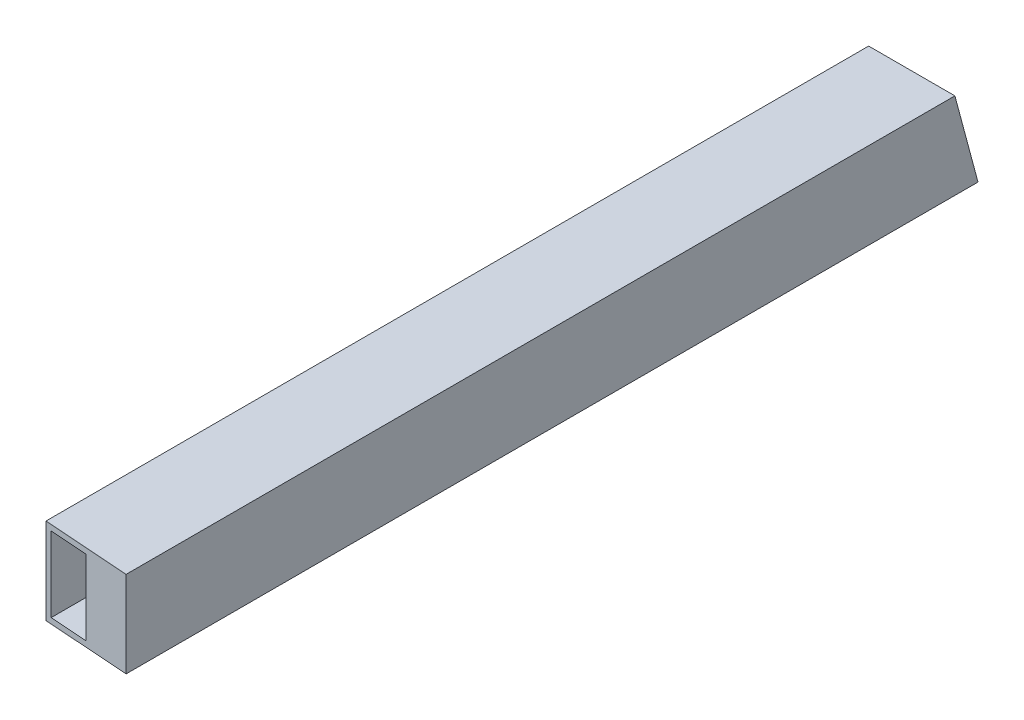
ISO-10303-21;
HEADER;
FILE_DESCRIPTION(('STEP AP214'),'2;1');
FILE_NAME('part.step','',(''),(''),'','','');
FILE_SCHEMA(('AUTOMOTIVE_DESIGN { 1 0 10303 214 1 1 1 1 }'));
ENDSEC;
DATA;
#1=APPLICATION_CONTEXT('core data for automotive mechanical design processes');
#2=APPLICATION_PROTOCOL_DEFINITION('international standard','automotive_design',2000,#1);
#3=PRODUCT_CONTEXT('',#1,'mechanical');
#4=PRODUCT('Part','Part','',(#3));
#5=PRODUCT_RELATED_PRODUCT_CATEGORY('part','',(#4));
#6=PRODUCT_DEFINITION_FORMATION('','',#4);
#7=PRODUCT_DEFINITION_CONTEXT('part definition',#1,'design');
#8=PRODUCT_DEFINITION('design','',#6,#7);
#9=PRODUCT_DEFINITION_SHAPE('','',#8);
#10=(LENGTH_UNIT() NAMED_UNIT(*) SI_UNIT(.MILLI.,.METRE.));
#11=(NAMED_UNIT(*) PLANE_ANGLE_UNIT() SI_UNIT($,.RADIAN.));
#12=(NAMED_UNIT(*) SI_UNIT($,.STERADIAN.) SOLID_ANGLE_UNIT());
#13=UNCERTAINTY_MEASURE_WITH_UNIT(LENGTH_MEASURE(1.E-05),#10,'distance_accuracy_value','');
#14=(GEOMETRIC_REPRESENTATION_CONTEXT(3) GLOBAL_UNCERTAINTY_ASSIGNED_CONTEXT((#13)) GLOBAL_UNIT_ASSIGNED_CONTEXT((#10,
#11,#12)) REPRESENTATION_CONTEXT('',''));
#15=CARTESIAN_POINT('',(0.,0.,0.));
#16=DIRECTION('',(0.,0.,1.));
#17=DIRECTION('',(1.,0.,0.));
#18=AXIS2_PLACEMENT_3D('',#15,#16,#17);
#19=CARTESIAN_POINT('',(-12.7,12.7,250.));
#20=DIRECTION('',(1.,0.,0.));
#21=DIRECTION('',(0.,0.,-1.));
#22=AXIS2_PLACEMENT_3D('',#19,#20,#21);
#23=PLANE('',#22);
#24=DIRECTION('',(0.,0.,-1.));
#25=VECTOR('',#24,1.);
#26=CARTESIAN_POINT('',(-12.7,12.7,250.));
#27=LINE('',#26,#25);
#28=CARTESIAN_POINT('',(-12.7,12.7,249.090766652216));
#29=VERTEX_POINT('',#28);
#30=CARTESIAN_POINT('',(-12.7,12.7,6.80590948775034));
#31=VERTEX_POINT('',#30);
#32=EDGE_CURVE('E112',#29,#31,#27,.T.);
#33=ORIENTED_EDGE('',*,*,#32,.T.);
#34=DIRECTION('',(0.,-0.96592582628907,-0.258819045102515));
#35=VECTOR('',#34,1.);
#36=CARTESIAN_POINT('',(-12.7,-12.7,0.));
#37=LINE('',#36,#35);
#38=CARTESIAN_POINT('',(-12.7,-12.7,0.));
#39=VERTEX_POINT('',#38);
#40=EDGE_CURVE('E104',#31,#39,#37,.T.);
#41=ORIENTED_EDGE('',*,*,#40,.T.);
#42=DIRECTION('',(0.,0.,-1.));
#43=VECTOR('',#42,1.);
#44=CARTESIAN_POINT('',(-12.7,-12.7,250.));
#45=LINE('',#44,#43);
#46=CARTESIAN_POINT('',(-12.7,-12.7,249.090766652216));
#47=VERTEX_POINT('',#46);
#48=EDGE_CURVE('E119',#47,#39,#45,.T.);
#49=ORIENTED_EDGE('',*,*,#48,.F.);
#50=DIRECTION('',(0.,-1.,0.));
#51=VECTOR('',#50,1.);
#52=CARTESIAN_POINT('',(-12.7,12.7,249.090766652216));
#53=LINE('',#52,#51);
#54=EDGE_CURVE('E153',#29,#47,#53,.T.);
#55=ORIENTED_EDGE('',*,*,#54,.F.);
#56=EDGE_LOOP('',(#33,#41,#49,#55));
#57=FACE_BOUND('',#56,.T.);
#58=ADVANCED_FACE('F33',(#57),#23,.F.);
#59=CARTESIAN_POINT('',(12.7,-12.7,250.));
#60=DIRECTION('',(0.,1.,0.));
#61=DIRECTION('',(-1.,0.,0.));
#62=AXIS2_PLACEMENT_3D('',#59,#60,#61);
#63=PLANE('',#62);
#64=DIRECTION('',(0.997447018462015,0.,0.0714104009317801));
#65=VECTOR('',#64,1.);
#66=CARTESIAN_POINT('',(12.6352370439123,-12.7,250.904596762007));
#67=LINE('',#66,#65);
#68=CARTESIAN_POINT('',(12.7,-12.7,250.909233347784));
#69=VERTEX_POINT('',#68);
#70=EDGE_CURVE('E125',#47,#69,#67,.T.);
#71=ORIENTED_EDGE('',*,*,#70,.F.);
#72=ORIENTED_EDGE('',*,*,#48,.T.);
#73=DIRECTION('',(1.,0.,0.));
#74=VECTOR('',#73,1.);
#75=CARTESIAN_POINT('',(12.7,-12.7,0.));
#76=LINE('',#75,#74);
#77=CARTESIAN_POINT('',(12.7,-12.7,0.));
#78=VERTEX_POINT('',#77);
#79=EDGE_CURVE('E101',#39,#78,#76,.T.);
#80=ORIENTED_EDGE('',*,*,#79,.T.);
#81=DIRECTION('',(0.,0.,-1.));
#82=VECTOR('',#81,1.);
#83=CARTESIAN_POINT('',(12.7,-12.7,250.));
#84=LINE('',#83,#82);
#85=EDGE_CURVE('E126',#69,#78,#84,.T.);
#86=ORIENTED_EDGE('',*,*,#85,.F.);
#87=EDGE_LOOP('',(#71,#72,#80,#86));
#88=FACE_BOUND('',#87,.T.);
#89=ADVANCED_FACE('F124',(#88),#63,.F.);
#90=CARTESIAN_POINT('',(12.7,12.7,250.));
#91=DIRECTION('',(-1.,0.,0.));
#92=DIRECTION('',(0.,-1.,0.));
#93=AXIS2_PLACEMENT_3D('',#90,#91,#92);
#94=PLANE('',#93);
#95=ORIENTED_EDGE('',*,*,#85,.T.);
#96=DIRECTION('',(0.,-0.96592582628907,-0.258819045102515));
#97=VECTOR('',#96,1.);
#98=CARTESIAN_POINT('',(12.7,-12.7,0.));
#99=LINE('',#98,#97);
#100=CARTESIAN_POINT('',(12.7,12.7,6.80590948775034));
#101=VERTEX_POINT('',#100);
#102=EDGE_CURVE('E107',#101,#78,#99,.T.);
#103=ORIENTED_EDGE('',*,*,#102,.F.);
#104=DIRECTION('',(0.,0.,-1.));
#105=VECTOR('',#104,1.);
#106=CARTESIAN_POINT('',(12.7,12.7,250.));
#107=LINE('',#106,#105);
#108=CARTESIAN_POINT('',(12.7,12.7,250.909233347784));
#109=VERTEX_POINT('',#108);
#110=EDGE_CURVE('E128',#109,#101,#107,.T.);
#111=ORIENTED_EDGE('',*,*,#110,.F.);
#112=DIRECTION('',(0.,1.,0.));
#113=VECTOR('',#112,1.);
#114=CARTESIAN_POINT('',(12.7,12.7,250.909233347784));
#115=LINE('',#114,#113);
#116=EDGE_CURVE('E54',#69,#109,#115,.T.);
#117=ORIENTED_EDGE('',*,*,#116,.F.);
#118=EDGE_LOOP('',(#95,#103,#111,#117));
#119=FACE_BOUND('',#118,.T.);
#120=ADVANCED_FACE('F212',(#119),#94,.F.);
#121=CARTESIAN_POINT('',(12.7,12.7,250.));
#122=DIRECTION('',(0.,-1.,0.));
#123=DIRECTION('',(1.,0.,0.));
#124=AXIS2_PLACEMENT_3D('',#121,#122,#123);
#125=PLANE('',#124);
#126=ORIENTED_EDGE('',*,*,#110,.T.);
#127=DIRECTION('',(-1.,0.,0.));
#128=VECTOR('',#127,1.);
#129=CARTESIAN_POINT('',(12.7,12.7,6.80590948775034));
#130=LINE('',#129,#128);
#131=EDGE_CURVE('E168',#101,#31,#130,.T.);
#132=ORIENTED_EDGE('',*,*,#131,.T.);
#133=ORIENTED_EDGE('',*,*,#32,.F.);
#134=DIRECTION('',(-0.997447018462015,0.,-0.0714104009317801));
#135=VECTOR('',#134,1.);
#136=CARTESIAN_POINT('',(30.9804418358443,12.7,252.217988255609));
#137=LINE('',#136,#135);
#138=EDGE_CURVE('E166',#109,#29,#137,.T.);
#139=ORIENTED_EDGE('',*,*,#138,.F.);
#140=EDGE_LOOP('',(#126,#132,#133,#139));
#141=FACE_BOUND('',#140,.T.);
#142=ADVANCED_FACE('F216',(#141),#125,.F.);
#143=CARTESIAN_POINT('',(-11.049,11.049,250.));
#144=DIRECTION('',(1.,0.,0.));
#145=DIRECTION('',(0.,1.,0.));
#146=AXIS2_PLACEMENT_3D('',#143,#144,#145);
#147=PLANE('',#146);
#148=DIRECTION('',(0.,-0.96592582628907,-0.258819045102515));
#149=VECTOR('',#148,1.);
#150=CARTESIAN_POINT('',(-11.049,71.958118657237,22.6840745269443));
#151=LINE('',#150,#149);
#152=CARTESIAN_POINT('',(-11.049,11.049,6.36352537104656));
#153=VERTEX_POINT('',#152);
#154=CARTESIAN_POINT('',(-11.049,-11.049,0.442384116703775));
#155=VERTEX_POINT('',#154);
#156=EDGE_CURVE('E170',#153,#155,#151,.T.);
#157=ORIENTED_EDGE('',*,*,#156,.F.);
#158=DIRECTION('',(0.,0.,-1.));
#159=VECTOR('',#158,1.);
#160=CARTESIAN_POINT('',(-11.049,11.049,250.));
#161=LINE('',#160,#159);
#162=CARTESIAN_POINT('',(-11.049,11.049,249.208966987428));
#163=VERTEX_POINT('',#162);
#164=EDGE_CURVE('E142',#163,#153,#161,.T.);
#165=ORIENTED_EDGE('',*,*,#164,.F.);
#166=DIRECTION('',(0.,-1.,0.));
#167=VECTOR('',#166,1.);
#168=CARTESIAN_POINT('',(-11.049,11.049,249.208966987428));
#169=LINE('',#168,#167);
#170=CARTESIAN_POINT('',(-11.049,-11.049,249.208966987428));
#171=VERTEX_POINT('',#170);
#172=EDGE_CURVE('E157',#163,#171,#169,.T.);
#173=ORIENTED_EDGE('',*,*,#172,.T.);
#174=DIRECTION('',(0.,0.,-1.));
#175=VECTOR('',#174,1.);
#176=CARTESIAN_POINT('',(-11.049,-11.049,250.));
#177=LINE('',#176,#175);
#178=EDGE_CURVE('E113',#171,#155,#177,.T.);
#179=ORIENTED_EDGE('',*,*,#178,.T.);
#180=EDGE_LOOP('',(#157,#165,#173,#179));
#181=FACE_BOUND('',#180,.T.);
#182=ADVANCED_FACE('F180',(#181),#147,.T.);
#183=CARTESIAN_POINT('',(11.049,-11.049,250.));
#184=DIRECTION('',(0.,1.,0.));
#185=DIRECTION('',(-1.,0.,0.));
#186=AXIS2_PLACEMENT_3D('',#183,#184,#185);
#187=PLANE('',#186);
#188=DIRECTION('',(1.,0.,0.));
#189=VECTOR('',#188,1.);
#190=CARTESIAN_POINT('',(11.049,-11.049,0.442384116703776));
#191=LINE('',#190,#189);
#192=CARTESIAN_POINT('',(11.049,-11.049,0.44238411670384));
#193=VERTEX_POINT('',#192);
#194=EDGE_CURVE('E46',#155,#193,#191,.T.);
#195=ORIENTED_EDGE('',*,*,#194,.F.);
#196=ORIENTED_EDGE('',*,*,#178,.F.);
#197=DIRECTION('',(0.997447018462015,0.,0.0714104009317801));
#198=VECTOR('',#197,1.);
#199=CARTESIAN_POINT('',(10.9926562282037,-11.049,250.786999182946));
#200=LINE('',#199,#198);
#201=CARTESIAN_POINT('',(0.,-11.049,250.));
#202=VERTEX_POINT('',#201);
#203=EDGE_CURVE('E160',#171,#202,#200,.T.);
#204=ORIENTED_EDGE('',*,*,#203,.T.);
#205=DIRECTION('',(1.,0.,0.));
#206=VECTOR('',#205,1.);
#207=CARTESIAN_POINT('',(11.049,-11.049,250.));
#208=LINE('',#207,#206);
#209=CARTESIAN_POINT('',(11.049,-11.049,250.));
#210=VERTEX_POINT('',#209);
#211=EDGE_CURVE('E151',#202,#210,#208,.T.);
#212=ORIENTED_EDGE('',*,*,#211,.T.);
#213=DIRECTION('',(0.,0.,-1.));
#214=VECTOR('',#213,1.);
#215=CARTESIAN_POINT('',(11.049,-11.049,250.));
#216=LINE('',#215,#214);
#217=EDGE_CURVE('E136',#210,#193,#216,.T.);
#218=ORIENTED_EDGE('',*,*,#217,.T.);
#219=EDGE_LOOP('',(#195,#196,#204,#212,#218));
#220=FACE_BOUND('',#219,.T.);
#221=ADVANCED_FACE('F192',(#220),#187,.T.);
#222=CARTESIAN_POINT('',(11.049,11.049,250.));
#223=DIRECTION('',(0.,-1.,0.));
#224=DIRECTION('',(1.,0.,0.));
#225=AXIS2_PLACEMENT_3D('',#222,#223,#224);
#226=PLANE('',#225);
#227=DIRECTION('',(-1.,0.,0.));
#228=VECTOR('',#227,1.);
#229=CARTESIAN_POINT('',(11.049,11.049,6.36352537104656));
#230=LINE('',#229,#228);
#231=CARTESIAN_POINT('',(11.049,11.049,6.36352537104659));
#232=VERTEX_POINT('',#231);
#233=EDGE_CURVE('E121',#232,#153,#230,.T.);
#234=ORIENTED_EDGE('',*,*,#233,.F.);
#235=DIRECTION('',(0.,0.,-1.));
#236=VECTOR('',#235,1.);
#237=CARTESIAN_POINT('',(11.049,11.049,250.));
#238=LINE('',#237,#236);
#239=CARTESIAN_POINT('',(11.049,11.049,250.));
#240=VERTEX_POINT('',#239);
#241=EDGE_CURVE('E139',#240,#232,#238,.T.);
#242=ORIENTED_EDGE('',*,*,#241,.F.);
#243=DIRECTION('',(-1.,0.,0.));
#244=VECTOR('',#243,1.);
#245=CARTESIAN_POINT('',(11.049,11.049,250.));
#246=LINE('',#245,#244);
#247=CARTESIAN_POINT('',(0.,11.049,250.));
#248=VERTEX_POINT('',#247);
#249=EDGE_CURVE('E145',#240,#248,#246,.T.);
#250=ORIENTED_EDGE('',*,*,#249,.T.);
#251=DIRECTION('',(-0.997447018462015,0.,-0.0714104009317801));
#252=VECTOR('',#251,1.);
#253=CARTESIAN_POINT('',(10.9926562282037,11.049,250.786999182946));
#254=LINE('',#253,#252);
#255=EDGE_CURVE('E163',#248,#163,#254,.T.);
#256=ORIENTED_EDGE('',*,*,#255,.T.);
#257=ORIENTED_EDGE('',*,*,#164,.T.);
#258=EDGE_LOOP('',(#234,#242,#250,#256,#257));
#259=FACE_BOUND('',#258,.T.);
#260=ADVANCED_FACE('F182',(#259),#226,.T.);
#261=CARTESIAN_POINT('',(0.,0.,250.));
#262=DIRECTION('',(0.,0.,1.));
#263=DIRECTION('',(1.,0.,0.));
#264=AXIS2_PLACEMENT_3D('',#261,#262,#263);
#265=PLANE('',#264);
#266=DIRECTION('',(0.,-1.,0.));
#267=VECTOR('',#266,1.);
#268=CARTESIAN_POINT('',(0.,0.,250.));
#269=LINE('',#268,#267);
#270=EDGE_CURVE('E40',#248,#202,#269,.T.);
#271=ORIENTED_EDGE('',*,*,#270,.F.);
#272=ORIENTED_EDGE('',*,*,#249,.F.);
#273=DIRECTION('',(0.,1.,0.));
#274=VECTOR('',#273,1.);
#275=CARTESIAN_POINT('',(11.049,11.049,250.));
#276=LINE('',#275,#274);
#277=EDGE_CURVE('E148',#210,#240,#276,.T.);
#278=ORIENTED_EDGE('',*,*,#277,.F.);
#279=ORIENTED_EDGE('',*,*,#211,.F.);
#280=EDGE_LOOP('',(#271,#272,#278,#279));
#281=FACE_BOUND('',#280,.T.);
#282=ADVANCED_FACE('F188',(#281),#265,.F.);
#283=CARTESIAN_POINT('',(11.049,11.049,250.));
#284=DIRECTION('',(-1.,0.,0.));
#285=DIRECTION('',(0.,-1.,0.));
#286=AXIS2_PLACEMENT_3D('',#283,#284,#285);
#287=PLANE('',#286);
#288=DIRECTION('',(0.,0.96592582628907,0.258819045102515));
#289=VECTOR('',#288,1.);
#290=CARTESIAN_POINT('',(11.049,71.958118657237,22.6840745269443));
#291=LINE('',#290,#289);
#292=EDGE_CURVE('E11',#193,#232,#291,.T.);
#293=ORIENTED_EDGE('',*,*,#292,.F.);
#294=ORIENTED_EDGE('',*,*,#217,.F.);
#295=ORIENTED_EDGE('',*,*,#277,.T.);
#296=ORIENTED_EDGE('',*,*,#241,.T.);
#297=EDGE_LOOP('',(#293,#294,#295,#296));
#298=FACE_BOUND('',#297,.T.);
#299=ADVANCED_FACE('F194',(#298),#287,.T.);
#300=CARTESIAN_POINT('',(30.9804418358443,12.7,252.217988255609));
#301=DIRECTION('',(-0.0714104009317801,0.,0.997447018462015));
#302=DIRECTION('',(0.997447018462015,0.,0.0714104009317801));
#303=AXIS2_PLACEMENT_3D('',#300,#301,#302);
#304=PLANE('',#303);
#305=ORIENTED_EDGE('',*,*,#255,.F.);
#306=ORIENTED_EDGE('',*,*,#270,.T.);
#307=ORIENTED_EDGE('',*,*,#203,.F.);
#308=ORIENTED_EDGE('',*,*,#172,.F.);
#309=EDGE_LOOP('',(#305,#306,#307,#308));
#310=FACE_BOUND('',#309,.T.);
#311=ORIENTED_EDGE('',*,*,#54,.T.);
#312=ORIENTED_EDGE('',*,*,#70,.T.);
#313=ORIENTED_EDGE('',*,*,#116,.T.);
#314=ORIENTED_EDGE('',*,*,#138,.T.);
#315=EDGE_LOOP('',(#311,#312,#313,#314));
#316=FACE_BOUND('',#315,.T.);
#317=ADVANCED_FACE('F185',(#310,#316),#304,.T.);
#318=CARTESIAN_POINT('',(-12.7,-12.7,0.));
#319=DIRECTION('',(0.,-0.258819045102515,0.96592582628907));
#320=DIRECTION('',(0.,-0.96592582628907,-0.258819045102515));
#321=AXIS2_PLACEMENT_3D('',#318,#319,#320);
#322=PLANE('',#321);
#323=ORIENTED_EDGE('',*,*,#156,.T.);
#324=ORIENTED_EDGE('',*,*,#194,.T.);
#325=ORIENTED_EDGE('',*,*,#292,.T.);
#326=ORIENTED_EDGE('',*,*,#233,.T.);
#327=EDGE_LOOP('',(#323,#324,#325,#326));
#328=FACE_BOUND('',#327,.T.);
#329=ORIENTED_EDGE('',*,*,#102,.T.);
#330=ORIENTED_EDGE('',*,*,#79,.F.);
#331=ORIENTED_EDGE('',*,*,#40,.F.);
#332=ORIENTED_EDGE('',*,*,#131,.F.);
#333=EDGE_LOOP('',(#329,#330,#331,#332));
#334=FACE_BOUND('',#333,.T.);
#335=ADVANCED_FACE('F103',(#328,#334),#322,.F.);
#336=CLOSED_SHELL('',(#58,#89,#120,#142,#182,#221,#260,#282,#299,#317,#335));
#337=MANIFOLD_SOLID_BREP('B2',#336);
#338=ADVANCED_BREP_SHAPE_REPRESENTATION('',(#18,#337),#14);
#339=SHAPE_DEFINITION_REPRESENTATION(#9,#338);
ENDSEC;
END-ISO-10303-21;
